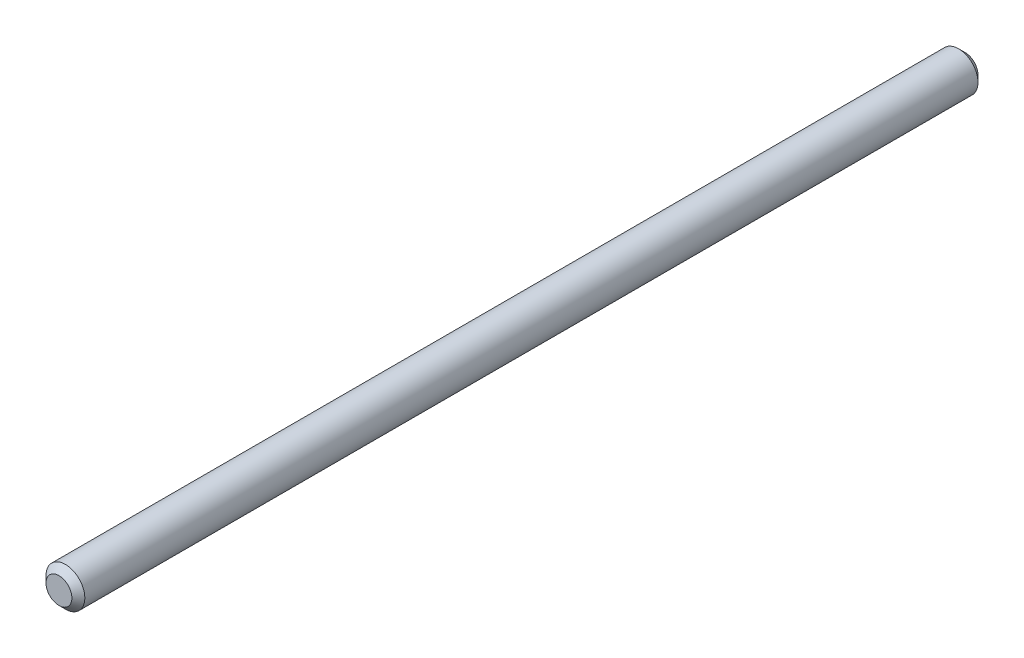
ISO-10303-21;
HEADER;
FILE_DESCRIPTION(('STEP AP214'),'2;1');
FILE_NAME('part.step','',(''),(''),'','','');
FILE_SCHEMA(('AUTOMOTIVE_DESIGN { 1 0 10303 214 1 1 1 1 }'));
ENDSEC;
DATA;
#1=APPLICATION_CONTEXT('core data for automotive mechanical design processes');
#2=APPLICATION_PROTOCOL_DEFINITION('international standard','automotive_design',2000,#1);
#3=PRODUCT_CONTEXT('',#1,'mechanical');
#4=PRODUCT('Part','Part','',(#3));
#5=PRODUCT_RELATED_PRODUCT_CATEGORY('part','',(#4));
#6=PRODUCT_DEFINITION_FORMATION('','',#4);
#7=PRODUCT_DEFINITION_CONTEXT('part definition',#1,'design');
#8=PRODUCT_DEFINITION('design','',#6,#7);
#9=PRODUCT_DEFINITION_SHAPE('','',#8);
#10=(LENGTH_UNIT() NAMED_UNIT(*) SI_UNIT(.MILLI.,.METRE.));
#11=(NAMED_UNIT(*) PLANE_ANGLE_UNIT() SI_UNIT($,.RADIAN.));
#12=(NAMED_UNIT(*) SI_UNIT($,.STERADIAN.) SOLID_ANGLE_UNIT());
#13=UNCERTAINTY_MEASURE_WITH_UNIT(LENGTH_MEASURE(1.E-05),#10,'distance_accuracy_value','');
#14=(GEOMETRIC_REPRESENTATION_CONTEXT(3) GLOBAL_UNCERTAINTY_ASSIGNED_CONTEXT((#13)) GLOBAL_UNIT_ASSIGNED_CONTEXT((#10,
#11,#12)) REPRESENTATION_CONTEXT('',''));
#15=CARTESIAN_POINT('',(0.,0.,0.));
#16=DIRECTION('',(0.,0.,1.));
#17=DIRECTION('',(1.,0.,0.));
#18=AXIS2_PLACEMENT_3D('',#15,#16,#17);
#19=CARTESIAN_POINT('',(0.,0.,-70.));
#20=DIRECTION('',(0.,0.,1.));
#21=DIRECTION('',(1.,0.,0.));
#22=AXIS2_PLACEMENT_3D('',#19,#20,#21);
#23=CYLINDRICAL_SURFACE('',#22,1.5);
#24=CARTESIAN_POINT('',(0.,0.,-69.5));
#25=DIRECTION('',(0.,0.,1.));
#26=DIRECTION('',(1.,0.,0.));
#27=AXIS2_PLACEMENT_3D('',#24,#25,#26);
#28=CIRCLE('',#27,1.5);
#29=CARTESIAN_POINT('',(1.5,0.,-69.5));
#30=VERTEX_POINT('',#29);
#31=EDGE_CURVE('E46',#30,#30,#28,.T.);
#32=ORIENTED_EDGE('',*,*,#31,.T.);
#33=EDGE_LOOP('',(#32));
#34=FACE_BOUND('',#33,.T.);
#35=CARTESIAN_POINT('',(0.,0.,-0.5));
#36=DIRECTION('',(0.,0.,1.));
#37=DIRECTION('',(1.,0.,0.));
#38=AXIS2_PLACEMENT_3D('',#35,#36,#37);
#39=CIRCLE('',#38,1.5);
#40=CARTESIAN_POINT('',(1.5,0.,-0.5));
#41=VERTEX_POINT('',#40);
#42=EDGE_CURVE('E50',#41,#41,#39,.F.);
#43=ORIENTED_EDGE('',*,*,#42,.T.);
#44=EDGE_LOOP('',(#43));
#45=FACE_BOUND('',#44,.T.);
#46=ADVANCED_FACE('F35',(#34,#45),#23,.T.);
#47=CARTESIAN_POINT('',(0.,0.,-70.));
#48=DIRECTION('',(0.,0.,1.));
#49=DIRECTION('',(1.,0.,0.));
#50=AXIS2_PLACEMENT_3D('',#47,#48,#49);
#51=PLANE('',#50);
#52=CARTESIAN_POINT('',(0.,0.,-70.));
#53=DIRECTION('',(0.,0.,1.));
#54=DIRECTION('',(1.,0.,0.));
#55=AXIS2_PLACEMENT_3D('',#52,#53,#54);
#56=CIRCLE('',#55,0.999999999999994);
#57=CARTESIAN_POINT('',(0.999999999999994,0.,-70.));
#58=VERTEX_POINT('',#57);
#59=EDGE_CURVE('E42',#58,#58,#56,.F.);
#60=ORIENTED_EDGE('',*,*,#59,.T.);
#61=EDGE_LOOP('',(#60));
#62=FACE_BOUND('',#61,.T.);
#63=ADVANCED_FACE('F66',(#62),#51,.F.);
#64=CARTESIAN_POINT('',(0.,0.,0.));
#65=DIRECTION('',(0.,0.,1.));
#66=DIRECTION('',(1.,0.,0.));
#67=AXIS2_PLACEMENT_3D('',#64,#65,#66);
#68=PLANE('',#67);
#69=CARTESIAN_POINT('',(0.,0.,0.));
#70=DIRECTION('',(0.,0.,1.));
#71=DIRECTION('',(1.,0.,0.));
#72=AXIS2_PLACEMENT_3D('',#69,#70,#71);
#73=CIRCLE('',#72,1.00000000000001);
#74=CARTESIAN_POINT('',(1.00000000000001,0.,0.));
#75=VERTEX_POINT('',#74);
#76=EDGE_CURVE('E10',#75,#75,#73,.T.);
#77=ORIENTED_EDGE('',*,*,#76,.T.);
#78=EDGE_LOOP('',(#77));
#79=FACE_BOUND('',#78,.T.);
#80=ADVANCED_FACE('F63',(#79),#68,.T.);
#81=CARTESIAN_POINT('',(0.,0.,-69.5));
#82=DIRECTION('',(0.,0.,1.));
#83=DIRECTION('',(1.,0.,0.));
#84=AXIS2_PLACEMENT_3D('',#81,#82,#83);
#85=CONICAL_SURFACE('',#84,1.5,0.785398163397454);
#86=ORIENTED_EDGE('',*,*,#59,.F.);
#87=EDGE_LOOP('',(#86));
#88=FACE_BOUND('',#87,.T.);
#89=ORIENTED_EDGE('',*,*,#31,.F.);
#90=EDGE_LOOP('',(#89));
#91=FACE_BOUND('',#90,.T.);
#92=ADVANCED_FACE('F59',(#88,#91),#85,.T.);
#93=CARTESIAN_POINT('',(0.,0.,0.));
#94=DIRECTION('',(0.,0.,-1.));
#95=DIRECTION('',(-1.,0.,0.));
#96=AXIS2_PLACEMENT_3D('',#93,#94,#95);
#97=CONICAL_SURFACE('',#96,1.00000000000001,0.78539816339744);
#98=ORIENTED_EDGE('',*,*,#42,.F.);
#99=EDGE_LOOP('',(#98));
#100=FACE_BOUND('',#99,.T.);
#101=ORIENTED_EDGE('',*,*,#76,.F.);
#102=EDGE_LOOP('',(#101));
#103=FACE_BOUND('',#102,.T.);
#104=ADVANCED_FACE('F37',(#100,#103),#97,.T.);
#105=CLOSED_SHELL('',(#46,#63,#80,#92,#104));
#106=MANIFOLD_SOLID_BREP('B2',#105);
#107=ADVANCED_BREP_SHAPE_REPRESENTATION('',(#18,#106),#14);
#108=SHAPE_DEFINITION_REPRESENTATION(#9,#107);
ENDSEC;
END-ISO-10303-21;
